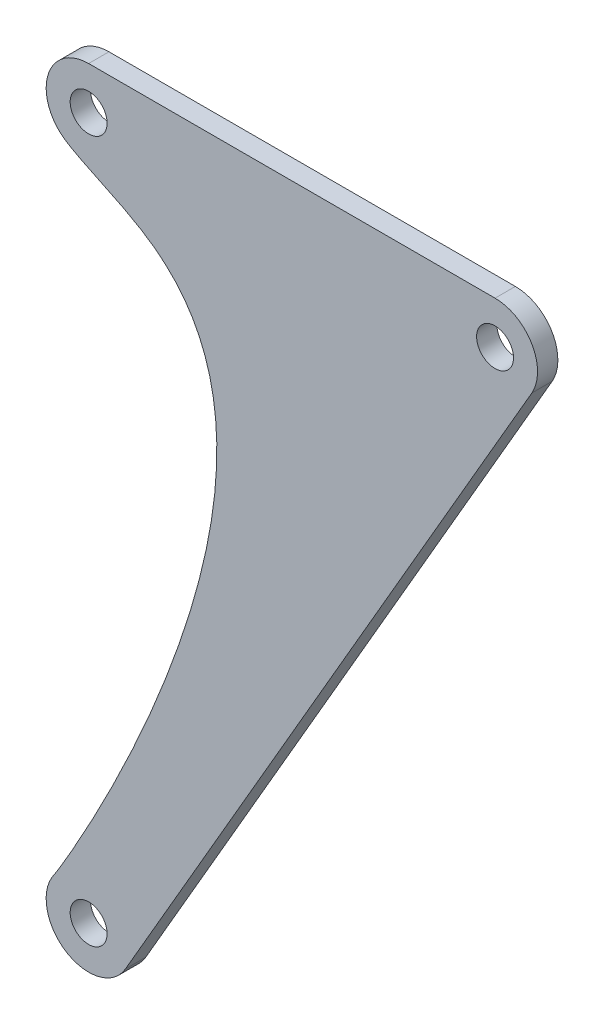
ISO-10303-21;
HEADER;
FILE_DESCRIPTION(('STEP AP214'),'2;1');
FILE_NAME('part.step','',(''),(''),'','','');
FILE_SCHEMA(('AUTOMOTIVE_DESIGN { 1 0 10303 214 1 1 1 1 }'));
ENDSEC;
DATA;
#1=APPLICATION_CONTEXT('core data for automotive mechanical design processes');
#2=APPLICATION_PROTOCOL_DEFINITION('international standard','automotive_design',2000,#1);
#3=PRODUCT_CONTEXT('',#1,'mechanical');
#4=PRODUCT('Part','Part','',(#3));
#5=PRODUCT_RELATED_PRODUCT_CATEGORY('part','',(#4));
#6=PRODUCT_DEFINITION_FORMATION('','',#4);
#7=PRODUCT_DEFINITION_CONTEXT('part definition',#1,'design');
#8=PRODUCT_DEFINITION('design','',#6,#7);
#9=PRODUCT_DEFINITION_SHAPE('','',#8);
#10=(LENGTH_UNIT() NAMED_UNIT(*) SI_UNIT(.MILLI.,.METRE.));
#11=(NAMED_UNIT(*) PLANE_ANGLE_UNIT() SI_UNIT($,.RADIAN.));
#12=(NAMED_UNIT(*) SI_UNIT($,.STERADIAN.) SOLID_ANGLE_UNIT());
#13=UNCERTAINTY_MEASURE_WITH_UNIT(LENGTH_MEASURE(1.E-05),#10,'distance_accuracy_value','');
#14=(GEOMETRIC_REPRESENTATION_CONTEXT(3) GLOBAL_UNCERTAINTY_ASSIGNED_CONTEXT((#13)) GLOBAL_UNIT_ASSIGNED_CONTEXT((#10,
#11,#12)) REPRESENTATION_CONTEXT('',''));
#15=CARTESIAN_POINT('',(0.,0.,0.));
#16=DIRECTION('',(0.,0.,1.));
#17=DIRECTION('',(1.,0.,0.));
#18=AXIS2_PLACEMENT_3D('',#15,#16,#17);
#19=CARTESIAN_POINT('',(0.,0.,2.75));
#20=DIRECTION('',(0.,0.,1.));
#21=DIRECTION('',(1.,0.,0.));
#22=AXIS2_PLACEMENT_3D('',#19,#20,#21);
#23=PLANE('',#22);
#24=CARTESIAN_POINT('',(-110.,-190.,2.75));
#25=DIRECTION('',(0.,0.,1.));
#26=DIRECTION('',(1.,0.,0.));
#27=AXIS2_PLACEMENT_3D('',#24,#25,#26);
#28=CIRCLE('',#27,5.00000000000001);
#29=CARTESIAN_POINT('',(-105.,-190.,2.75));
#30=VERTEX_POINT('',#29);
#31=EDGE_CURVE('E215',#30,#30,#28,.T.);
#32=ORIENTED_EDGE('',*,*,#31,.F.);
#33=EDGE_LOOP('',(#32));
#34=FACE_BOUND('',#33,.T.);
#35=CARTESIAN_POINT('',(0.,0.,2.75));
#36=DIRECTION('',(0.,0.,1.));
#37=DIRECTION('',(1.,0.,0.));
#38=AXIS2_PLACEMENT_3D('',#35,#36,#37);
#39=CIRCLE('',#38,11.5);
#40=CARTESIAN_POINT('',(9.95240228303295,-5.7619171112296,2.75));
#41=VERTEX_POINT('',#40);
#42=CARTESIAN_POINT('',(0.,11.5,2.75));
#43=VERTEX_POINT('',#42);
#44=EDGE_CURVE('E154',#41,#43,#39,.T.);
#45=ORIENTED_EDGE('',*,*,#44,.T.);
#46=DIRECTION('',(-1.,0.,0.));
#47=VECTOR('',#46,1.);
#48=CARTESIAN_POINT('',(-110.,11.5,2.75));
#49=LINE('',#48,#47);
#50=CARTESIAN_POINT('',(-110.,11.5,2.75));
#51=VERTEX_POINT('',#50);
#52=EDGE_CURVE('E94',#43,#51,#49,.T.);
#53=ORIENTED_EDGE('',*,*,#52,.T.);
#54=CARTESIAN_POINT('',(-110.,0.,2.75));
#55=DIRECTION('',(0.,0.,1.));
#56=DIRECTION('',(1.,0.,0.));
#57=AXIS2_PLACEMENT_3D('',#54,#55,#56);
#58=CIRCLE('',#57,11.5);
#59=CARTESIAN_POINT('',(-117.582652102444,-8.64600411133929,2.75));
#60=VERTEX_POINT('',#59);
#61=EDGE_CURVE('E107',#51,#60,#58,.T.);
#62=ORIENTED_EDGE('',*,*,#61,.T.);
#63=CARTESIAN_POINT('',(-117.582652102444,-8.64600411133929,2.75));
#64=CARTESIAN_POINT('',(-113.500583088559,-12.2260289172341,2.75));
#65=CARTESIAN_POINT('',(-89.3431368382826,-20.2497233079463,2.75));
#66=CARTESIAN_POINT('',(-54.5299550205771,-76.6994790796532,2.75));
#67=CARTESIAN_POINT('',(-117.517833386342,-180.829058186392,2.75));
#68=CARTESIAN_POINT('',(-119.240449642834,-183.15426480221,2.75));
#69=B_SPLINE_CURVE_WITH_KNOTS('',3,(#63,#64,#65,#66,#67,#68),.UNSPECIFIED.,.F.,.F.,(4,1,1,4),
(0.,0.138535768477996,0.282875598868406,1.),.UNSPECIFIED.);
#70=CARTESIAN_POINT('',(-119.240449642834,-183.15426480221,2.75));
#71=VERTEX_POINT('',#70);
#72=EDGE_CURVE('E101',#60,#71,#69,.T.);
#73=ORIENTED_EDGE('',*,*,#72,.T.);
#74=CARTESIAN_POINT('',(-110.,-190.,2.75));
#75=DIRECTION('',(0.,0.,1.));
#76=DIRECTION('',(1.,0.,0.));
#77=AXIS2_PLACEMENT_3D('',#74,#75,#76);
#78=CIRCLE('',#77,11.5);
#79=CARTESIAN_POINT('',(-100.047597716967,-195.76191711123,2.75));
#80=VERTEX_POINT('',#79);
#81=EDGE_CURVE('E105',#71,#80,#78,.T.);
#82=ORIENTED_EDGE('',*,*,#81,.T.);
#83=DIRECTION('',(0.501036270541705,0.865426285481126,0.));
#84=VECTOR('',#83,1.);
#85=CARTESIAN_POINT('',(9.95240228303295,-5.7619171112296,2.75));
#86=LINE('',#85,#84);
#87=EDGE_CURVE('E57',#80,#41,#86,.T.);
#88=ORIENTED_EDGE('',*,*,#87,.T.);
#89=EDGE_LOOP('',(#45,#53,#62,#73,#82,#88));
#90=FACE_BOUND('',#89,.T.);
#91=CARTESIAN_POINT('',(0.,0.,2.75));
#92=DIRECTION('',(0.,0.,1.));
#93=DIRECTION('',(1.,0.,0.));
#94=AXIS2_PLACEMENT_3D('',#91,#92,#93);
#95=CIRCLE('',#94,5.);
#96=CARTESIAN_POINT('',(5.,0.,2.75));
#97=VERTEX_POINT('',#96);
#98=EDGE_CURVE('E137',#97,#97,#95,.T.);
#99=ORIENTED_EDGE('',*,*,#98,.F.);
#100=EDGE_LOOP('',(#99));
#101=FACE_BOUND('',#100,.T.);
#102=CARTESIAN_POINT('',(-110.,0.,2.75));
#103=DIRECTION('',(0.,0.,1.));
#104=DIRECTION('',(1.,0.,0.));
#105=AXIS2_PLACEMENT_3D('',#102,#103,#104);
#106=CIRCLE('',#105,5.);
#107=CARTESIAN_POINT('',(-105.,0.,2.75));
#108=VERTEX_POINT('',#107);
#109=EDGE_CURVE('E204',#108,#108,#106,.T.);
#110=ORIENTED_EDGE('',*,*,#109,.F.);
#111=EDGE_LOOP('',(#110));
#112=FACE_BOUND('',#111,.T.);
#113=ADVANCED_FACE('F39',(#34,#90,#101,#112),#23,.T.);
#114=CARTESIAN_POINT('',(0.,0.,-2.75));
#115=DIRECTION('',(0.,0.,1.));
#116=DIRECTION('',(1.,0.,0.));
#117=AXIS2_PLACEMENT_3D('',#114,#115,#116);
#118=PLANE('',#117);
#119=CARTESIAN_POINT('',(0.,0.,-2.75));
#120=DIRECTION('',(0.,0.,1.));
#121=DIRECTION('',(1.,0.,0.));
#122=AXIS2_PLACEMENT_3D('',#119,#120,#121);
#123=CIRCLE('',#122,11.5);
#124=CARTESIAN_POINT('',(9.95240228303295,-5.7619171112296,-2.75));
#125=VERTEX_POINT('',#124);
#126=CARTESIAN_POINT('',(0.,11.5,-2.75));
#127=VERTEX_POINT('',#126);
#128=EDGE_CURVE('E132',#125,#127,#123,.T.);
#129=ORIENTED_EDGE('',*,*,#128,.F.);
#130=DIRECTION('',(0.501036270541705,0.865426285481126,0.));
#131=VECTOR('',#130,1.);
#132=CARTESIAN_POINT('',(9.95240228303295,-5.7619171112296,-2.75));
#133=LINE('',#132,#131);
#134=CARTESIAN_POINT('',(-100.047597716967,-195.76191711123,-2.75));
#135=VERTEX_POINT('',#134);
#136=EDGE_CURVE('E86',#135,#125,#133,.T.);
#137=ORIENTED_EDGE('',*,*,#136,.F.);
#138=CARTESIAN_POINT('',(-110.,-190.,-2.75));
#139=DIRECTION('',(0.,0.,1.));
#140=DIRECTION('',(1.,0.,0.));
#141=AXIS2_PLACEMENT_3D('',#138,#139,#140);
#142=CIRCLE('',#141,11.5);
#143=CARTESIAN_POINT('',(-119.240449642834,-183.15426480221,-2.75));
#144=VERTEX_POINT('',#143);
#145=EDGE_CURVE('E80',#144,#135,#142,.T.);
#146=ORIENTED_EDGE('',*,*,#145,.F.);
#147=CARTESIAN_POINT('',(-117.582652102444,-8.64600411133929,-2.75));
#148=CARTESIAN_POINT('',(-113.500583088559,-12.2260289172341,-2.75));
#149=CARTESIAN_POINT('',(-89.3431368382826,-20.2497233079463,-2.75));
#150=CARTESIAN_POINT('',(-54.5299550205771,-76.6994790796532,-2.75));
#151=CARTESIAN_POINT('',(-117.517833386342,-180.829058186392,-2.75));
#152=CARTESIAN_POINT('',(-119.240449642834,-183.15426480221,-2.75));
#153=B_SPLINE_CURVE_WITH_KNOTS('',3,(#147,#148,#149,#150,#151,#152),.UNSPECIFIED.,.F.,.F.,(4,1,
1,4),(0.,0.138535768477996,0.282875598868406,1.),.UNSPECIFIED.);
#154=CARTESIAN_POINT('',(-117.582652102444,-8.64600411133929,-2.75));
#155=VERTEX_POINT('',#154);
#156=EDGE_CURVE('E116',#155,#144,#153,.T.);
#157=ORIENTED_EDGE('',*,*,#156,.F.);
#158=CARTESIAN_POINT('',(-110.,0.,-2.75));
#159=DIRECTION('',(0.,0.,1.));
#160=DIRECTION('',(1.,0.,0.));
#161=AXIS2_PLACEMENT_3D('',#158,#159,#160);
#162=CIRCLE('',#161,11.5);
#163=CARTESIAN_POINT('',(-110.,11.5,-2.75));
#164=VERTEX_POINT('',#163);
#165=EDGE_CURVE('E140',#164,#155,#162,.T.);
#166=ORIENTED_EDGE('',*,*,#165,.F.);
#167=DIRECTION('',(-1.,0.,0.));
#168=VECTOR('',#167,1.);
#169=CARTESIAN_POINT('',(-110.,11.5,-2.75));
#170=LINE('',#169,#168);
#171=EDGE_CURVE('E136',#127,#164,#170,.T.);
#172=ORIENTED_EDGE('',*,*,#171,.F.);
#173=EDGE_LOOP('',(#129,#137,#146,#157,#166,#172));
#174=FACE_BOUND('',#173,.T.);
#175=CARTESIAN_POINT('',(0.,0.,-2.75));
#176=DIRECTION('',(0.,0.,1.));
#177=DIRECTION('',(1.,0.,0.));
#178=AXIS2_PLACEMENT_3D('',#175,#176,#177);
#179=CIRCLE('',#178,5.);
#180=CARTESIAN_POINT('',(5.,0.,-2.75));
#181=VERTEX_POINT('',#180);
#182=EDGE_CURVE('E219',#181,#181,#179,.T.);
#183=ORIENTED_EDGE('',*,*,#182,.T.);
#184=EDGE_LOOP('',(#183));
#185=FACE_BOUND('',#184,.T.);
#186=CARTESIAN_POINT('',(-110.,-190.,-2.75));
#187=DIRECTION('',(0.,0.,1.));
#188=DIRECTION('',(1.,0.,0.));
#189=AXIS2_PLACEMENT_3D('',#186,#187,#188);
#190=CIRCLE('',#189,5.00000000000001);
#191=CARTESIAN_POINT('',(-105.,-190.,-2.75));
#192=VERTEX_POINT('',#191);
#193=EDGE_CURVE('E212',#192,#192,#190,.T.);
#194=ORIENTED_EDGE('',*,*,#193,.T.);
#195=EDGE_LOOP('',(#194));
#196=FACE_BOUND('',#195,.T.);
#197=CARTESIAN_POINT('',(-110.,0.,-2.75));
#198=DIRECTION('',(0.,0.,1.));
#199=DIRECTION('',(1.,0.,0.));
#200=AXIS2_PLACEMENT_3D('',#197,#198,#199);
#201=CIRCLE('',#200,5.);
#202=CARTESIAN_POINT('',(-105.,0.,-2.75));
#203=VERTEX_POINT('',#202);
#204=EDGE_CURVE('E207',#203,#203,#201,.T.);
#205=ORIENTED_EDGE('',*,*,#204,.T.);
#206=EDGE_LOOP('',(#205));
#207=FACE_BOUND('',#206,.T.);
#208=ADVANCED_FACE('F167',(#174,#185,#196,#207),#118,.F.);
#209=CARTESIAN_POINT('',(0.,0.,2.75));
#210=DIRECTION('',(0.,0.,-1.));
#211=DIRECTION('',(-1.,0.,0.));
#212=AXIS2_PLACEMENT_3D('',#209,#210,#211);
#213=CYLINDRICAL_SURFACE('',#212,11.5);
#214=ORIENTED_EDGE('',*,*,#128,.T.);
#215=DIRECTION('',(0.,0.,-1.));
#216=VECTOR('',#215,1.);
#217=CARTESIAN_POINT('',(0.,11.5,2.75));
#218=LINE('',#217,#216);
#219=EDGE_CURVE('E11',#43,#127,#218,.T.);
#220=ORIENTED_EDGE('',*,*,#219,.F.);
#221=ORIENTED_EDGE('',*,*,#44,.F.);
#222=DIRECTION('',(0.,0.,-1.));
#223=VECTOR('',#222,1.);
#224=CARTESIAN_POINT('',(9.95240228303295,-5.7619171112296,2.75));
#225=LINE('',#224,#223);
#226=EDGE_CURVE('E125',#41,#125,#225,.T.);
#227=ORIENTED_EDGE('',*,*,#226,.T.);
#228=EDGE_LOOP('',(#214,#220,#221,#227));
#229=FACE_BOUND('',#228,.T.);
#230=ADVANCED_FACE('F41',(#229),#213,.T.);
#231=CARTESIAN_POINT('',(-110.,11.5,2.75));
#232=DIRECTION('',(0.,-1.,0.));
#233=DIRECTION('',(1.,0.,0.));
#234=AXIS2_PLACEMENT_3D('',#231,#232,#233);
#235=PLANE('',#234);
#236=ORIENTED_EDGE('',*,*,#171,.T.);
#237=DIRECTION('',(0.,0.,-1.));
#238=VECTOR('',#237,1.);
#239=CARTESIAN_POINT('',(-110.,11.5,2.75));
#240=LINE('',#239,#238);
#241=EDGE_CURVE('E49',#51,#164,#240,.T.);
#242=ORIENTED_EDGE('',*,*,#241,.F.);
#243=ORIENTED_EDGE('',*,*,#52,.F.);
#244=ORIENTED_EDGE('',*,*,#219,.T.);
#245=EDGE_LOOP('',(#236,#242,#243,#244));
#246=FACE_BOUND('',#245,.T.);
#247=ADVANCED_FACE('F275',(#246),#235,.F.);
#248=CARTESIAN_POINT('',(-110.,0.,2.75));
#249=DIRECTION('',(0.,0.,-1.));
#250=DIRECTION('',(-1.,0.,0.));
#251=AXIS2_PLACEMENT_3D('',#248,#249,#250);
#252=CYLINDRICAL_SURFACE('',#251,11.5);
#253=ORIENTED_EDGE('',*,*,#165,.T.);
#254=DIRECTION('',(0.,0.,-1.));
#255=VECTOR('',#254,1.);
#256=CARTESIAN_POINT('',(-117.582652102444,-8.64600411133929,2.75));
#257=LINE('',#256,#255);
#258=EDGE_CURVE('E118',#60,#155,#257,.T.);
#259=ORIENTED_EDGE('',*,*,#258,.F.);
#260=ORIENTED_EDGE('',*,*,#61,.F.);
#261=ORIENTED_EDGE('',*,*,#241,.T.);
#262=EDGE_LOOP('',(#253,#259,#260,#261));
#263=FACE_BOUND('',#262,.T.);
#264=ADVANCED_FACE('F164',(#263),#252,.T.);
#265=DIRECTION('',(0.,0.,-1.));
#266=VECTOR('',#265,1.);
#267=SURFACE_OF_LINEAR_EXTRUSION('',#69,#266);
#268=ORIENTED_EDGE('',*,*,#156,.T.);
#269=DIRECTION('',(0.,0.,-1.));
#270=VECTOR('',#269,1.);
#271=CARTESIAN_POINT('',(-119.240449642834,-183.15426480221,2.75));
#272=LINE('',#271,#270);
#273=EDGE_CURVE('E113',#71,#144,#272,.T.);
#274=ORIENTED_EDGE('',*,*,#273,.F.);
#275=ORIENTED_EDGE('',*,*,#72,.F.);
#276=ORIENTED_EDGE('',*,*,#258,.T.);
#277=EDGE_LOOP('',(#268,#274,#275,#276));
#278=FACE_BOUND('',#277,.T.);
#279=ADVANCED_FACE('F114',(#278),#267,.F.);
#280=CARTESIAN_POINT('',(-110.,-190.,2.75));
#281=DIRECTION('',(0.,0.,-1.));
#282=DIRECTION('',(-1.,0.,0.));
#283=AXIS2_PLACEMENT_3D('',#280,#281,#282);
#284=CYLINDRICAL_SURFACE('',#283,11.5);
#285=ORIENTED_EDGE('',*,*,#145,.T.);
#286=DIRECTION('',(0.,0.,-1.));
#287=VECTOR('',#286,1.);
#288=CARTESIAN_POINT('',(-100.047597716967,-195.76191711123,2.75));
#289=LINE('',#288,#287);
#290=EDGE_CURVE('E119',#80,#135,#289,.T.);
#291=ORIENTED_EDGE('',*,*,#290,.F.);
#292=ORIENTED_EDGE('',*,*,#81,.F.);
#293=ORIENTED_EDGE('',*,*,#273,.T.);
#294=EDGE_LOOP('',(#285,#291,#292,#293));
#295=FACE_BOUND('',#294,.T.);
#296=ADVANCED_FACE('F121',(#295),#284,.T.);
#297=CARTESIAN_POINT('',(9.95240228303295,-5.7619171112296,2.75));
#298=DIRECTION('',(-0.865426285481126,0.501036270541705,0.));
#299=DIRECTION('',(-0.501036270541705,-0.865426285481126,0.));
#300=AXIS2_PLACEMENT_3D('',#297,#298,#299);
#301=PLANE('',#300);
#302=ORIENTED_EDGE('',*,*,#136,.T.);
#303=ORIENTED_EDGE('',*,*,#226,.F.);
#304=ORIENTED_EDGE('',*,*,#87,.F.);
#305=ORIENTED_EDGE('',*,*,#290,.T.);
#306=EDGE_LOOP('',(#302,#303,#304,#305));
#307=FACE_BOUND('',#306,.T.);
#308=ADVANCED_FACE('F172',(#307),#301,.F.);
#309=CARTESIAN_POINT('',(0.,0.,2.75));
#310=DIRECTION('',(0.,0.,-1.));
#311=DIRECTION('',(-1.,0.,0.));
#312=AXIS2_PLACEMENT_3D('',#309,#310,#311);
#313=CYLINDRICAL_SURFACE('',#312,5.);
#314=ORIENTED_EDGE('',*,*,#98,.T.);
#315=EDGE_LOOP('',(#314));
#316=FACE_BOUND('',#315,.T.);
#317=ORIENTED_EDGE('',*,*,#182,.F.);
#318=EDGE_LOOP('',(#317));
#319=FACE_BOUND('',#318,.T.);
#320=ADVANCED_FACE('F174',(#316,#319),#313,.F.);
#321=CARTESIAN_POINT('',(-110.,-190.,2.75));
#322=DIRECTION('',(0.,0.,-1.));
#323=DIRECTION('',(-1.,0.,0.));
#324=AXIS2_PLACEMENT_3D('',#321,#322,#323);
#325=CYLINDRICAL_SURFACE('',#324,5.00000000000001);
#326=ORIENTED_EDGE('',*,*,#31,.T.);
#327=EDGE_LOOP('',(#326));
#328=FACE_BOUND('',#327,.T.);
#329=ORIENTED_EDGE('',*,*,#193,.F.);
#330=EDGE_LOOP('',(#329));
#331=FACE_BOUND('',#330,.T.);
#332=ADVANCED_FACE('F180',(#328,#331),#325,.F.);
#333=CARTESIAN_POINT('',(-110.,0.,2.75));
#334=DIRECTION('',(0.,0.,-1.));
#335=DIRECTION('',(-1.,0.,0.));
#336=AXIS2_PLACEMENT_3D('',#333,#334,#335);
#337=CYLINDRICAL_SURFACE('',#336,5.);
#338=ORIENTED_EDGE('',*,*,#109,.T.);
#339=EDGE_LOOP('',(#338));
#340=FACE_BOUND('',#339,.T.);
#341=ORIENTED_EDGE('',*,*,#204,.F.);
#342=EDGE_LOOP('',(#341));
#343=FACE_BOUND('',#342,.T.);
#344=ADVANCED_FACE('F195',(#340,#343),#337,.F.);
#345=CLOSED_SHELL('',(#113,#208,#230,#247,#264,#279,#296,#308,#320,#332,#344));
#346=MANIFOLD_SOLID_BREP('B2',#345);
#347=ADVANCED_BREP_SHAPE_REPRESENTATION('',(#18,#346),#14);
#348=SHAPE_DEFINITION_REPRESENTATION(#9,#347);
ENDSEC;
END-ISO-10303-21;
